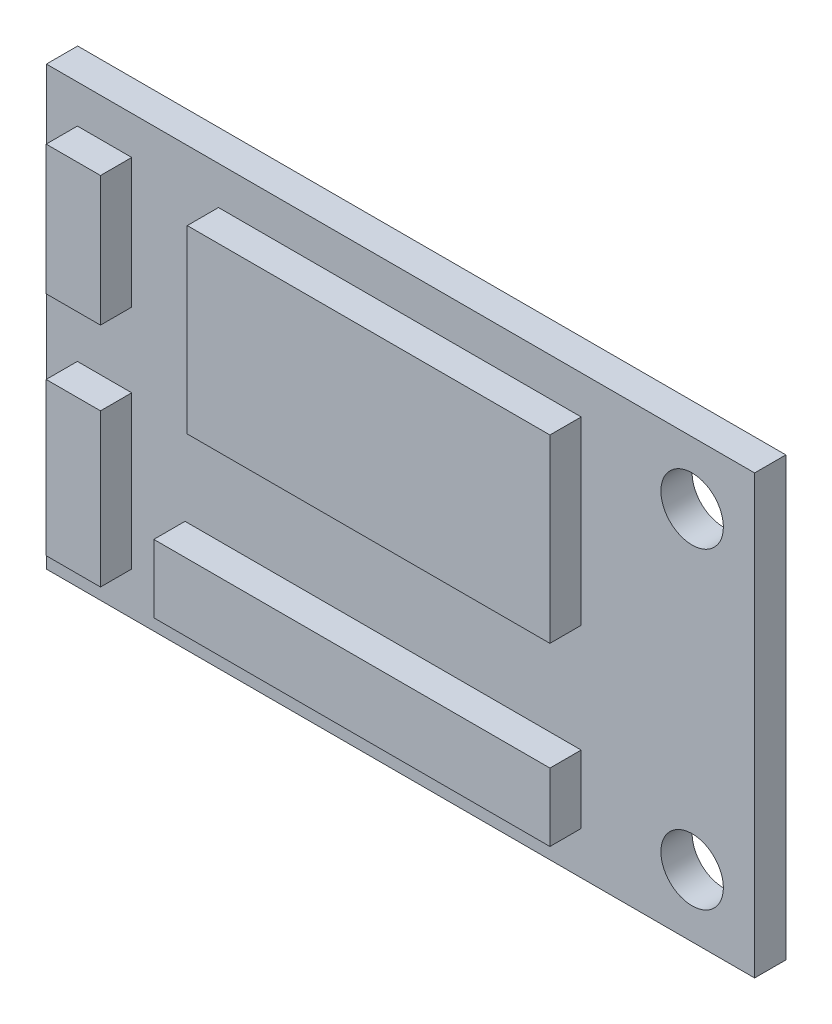
ISO-10303-21;
HEADER;
FILE_DESCRIPTION(('STEP AP214'),'2;1');
FILE_NAME('part.step','',(''),(''),'','','');
FILE_SCHEMA(('AUTOMOTIVE_DESIGN { 1 0 10303 214 1 1 1 1 }'));
ENDSEC;
DATA;
#1=APPLICATION_CONTEXT('core data for automotive mechanical design processes');
#2=APPLICATION_PROTOCOL_DEFINITION('international standard','automotive_design',2000,#1);
#3=PRODUCT_CONTEXT('',#1,'mechanical');
#4=PRODUCT('Part','Part','',(#3));
#5=PRODUCT_RELATED_PRODUCT_CATEGORY('part','',(#4));
#6=PRODUCT_DEFINITION_FORMATION('','',#4);
#7=PRODUCT_DEFINITION_CONTEXT('part definition',#1,'design');
#8=PRODUCT_DEFINITION('design','',#6,#7);
#9=PRODUCT_DEFINITION_SHAPE('','',#8);
#10=(LENGTH_UNIT() NAMED_UNIT(*) SI_UNIT(.MILLI.,.METRE.));
#11=(NAMED_UNIT(*) PLANE_ANGLE_UNIT() SI_UNIT($,.RADIAN.));
#12=(NAMED_UNIT(*) SI_UNIT($,.STERADIAN.) SOLID_ANGLE_UNIT());
#13=UNCERTAINTY_MEASURE_WITH_UNIT(LENGTH_MEASURE(1.E-05),#10,'distance_accuracy_value','');
#14=(GEOMETRIC_REPRESENTATION_CONTEXT(3) GLOBAL_UNCERTAINTY_ASSIGNED_CONTEXT((#13)) GLOBAL_UNIT_ASSIGNED_CONTEXT((#10,
#11,#12)) REPRESENTATION_CONTEXT('',''));
#15=CARTESIAN_POINT('',(0.,0.,0.));
#16=DIRECTION('',(0.,0.,1.));
#17=DIRECTION('',(1.,0.,0.));
#18=AXIS2_PLACEMENT_3D('',#15,#16,#17);
#19=CARTESIAN_POINT('',(0.,0.,1.5));
#20=DIRECTION('',(0.,0.,1.));
#21=DIRECTION('',(1.,0.,0.));
#22=AXIS2_PLACEMENT_3D('',#19,#20,#21);
#23=PLANE('',#22);
#24=CARTESIAN_POINT('',(14.,7.5,1.5));
#25=DIRECTION('',(0.,0.,1.));
#26=DIRECTION('',(1.,0.,0.));
#27=AXIS2_PLACEMENT_3D('',#24,#25,#26);
#28=CIRCLE('',#27,1.5);
#29=CARTESIAN_POINT('',(15.5,7.5,1.5));
#30=VERTEX_POINT('',#29);
#31=EDGE_CURVE('E305',#30,#30,#28,.T.);
#32=ORIENTED_EDGE('',*,*,#31,.F.);
#33=EDGE_LOOP('',(#32));
#34=FACE_BOUND('',#33,.T.);
#35=DIRECTION('',(0.,-1.,0.));
#36=VECTOR('',#35,1.);
#37=CARTESIAN_POINT('',(-17.,-10.5,1.5));
#38=LINE('',#37,#36);
#39=CARTESIAN_POINT('',(-17.,10.5,1.5));
#40=VERTEX_POINT('',#39);
#41=CARTESIAN_POINT('',(-17.,-10.5,1.5));
#42=VERTEX_POINT('',#41);
#43=EDGE_CURVE('E312',#40,#42,#38,.T.);
#44=ORIENTED_EDGE('',*,*,#43,.T.);
#45=DIRECTION('',(1.,0.,0.));
#46=VECTOR('',#45,1.);
#47=CARTESIAN_POINT('',(17.,-10.5,1.5));
#48=LINE('',#47,#46);
#49=CARTESIAN_POINT('',(17.,-10.5,1.5));
#50=VERTEX_POINT('',#49);
#51=EDGE_CURVE('E316',#42,#50,#48,.T.);
#52=ORIENTED_EDGE('',*,*,#51,.T.);
#53=DIRECTION('',(0.,1.,0.));
#54=VECTOR('',#53,1.);
#55=CARTESIAN_POINT('',(17.,-10.5,1.5));
#56=LINE('',#55,#54);
#57=CARTESIAN_POINT('',(17.,10.5,1.5));
#58=VERTEX_POINT('',#57);
#59=EDGE_CURVE('E319',#50,#58,#56,.T.);
#60=ORIENTED_EDGE('',*,*,#59,.T.);
#61=DIRECTION('',(-1.,0.,0.));
#62=VECTOR('',#61,1.);
#63=CARTESIAN_POINT('',(17.,10.5,1.5));
#64=LINE('',#63,#62);
#65=EDGE_CURVE('E322',#58,#40,#64,.T.);
#66=ORIENTED_EDGE('',*,*,#65,.T.);
#67=EDGE_LOOP('',(#44,#52,#60,#66));
#68=FACE_BOUND('',#67,.T.);
#69=CARTESIAN_POINT('',(14.,-7.5,1.5));
#70=DIRECTION('',(0.,0.,1.));
#71=DIRECTION('',(1.,0.,0.));
#72=AXIS2_PLACEMENT_3D('',#69,#70,#71);
#73=CIRCLE('',#72,1.5);
#74=CARTESIAN_POINT('',(15.5,-7.5,1.5));
#75=VERTEX_POINT('',#74);
#76=EDGE_CURVE('E297',#75,#75,#73,.T.);
#77=ORIENTED_EDGE('',*,*,#76,.F.);
#78=EDGE_LOOP('',(#77));
#79=FACE_BOUND('',#78,.T.);
#80=DIRECTION('',(1.,0.,0.));
#81=VECTOR('',#80,1.);
#82=CARTESIAN_POINT('',(-15.5131375674324,2.44222509799984,1.5));
#83=LINE('',#82,#81);
#84=CARTESIAN_POINT('',(-15.5131375674324,2.44222509799984,1.5));
#85=VERTEX_POINT('',#84);
#86=CARTESIAN_POINT('',(-12.9038053424862,2.44222509799984,1.5));
#87=VERTEX_POINT('',#86);
#88=EDGE_CURVE('E281',#85,#87,#83,.T.);
#89=ORIENTED_EDGE('',*,*,#88,.F.);
#90=DIRECTION('',(0.,-1.,0.));
#91=VECTOR('',#90,1.);
#92=CARTESIAN_POINT('',(-15.5131375674324,8.66447886517924,1.5));
#93=LINE('',#92,#91);
#94=CARTESIAN_POINT('',(-15.5131375674324,8.66447886517924,1.5));
#95=VERTEX_POINT('',#94);
#96=EDGE_CURVE('E266',#95,#85,#93,.T.);
#97=ORIENTED_EDGE('',*,*,#96,.F.);
#98=DIRECTION('',(-1.,0.,0.));
#99=VECTOR('',#98,1.);
#100=CARTESIAN_POINT('',(-15.5131375674324,8.66447886517924,1.5));
#101=LINE('',#100,#99);
#102=CARTESIAN_POINT('',(-12.9038053424862,8.66447886517924,1.5));
#103=VERTEX_POINT('',#102);
#104=EDGE_CURVE('E272',#103,#95,#101,.T.);
#105=ORIENTED_EDGE('',*,*,#104,.F.);
#106=DIRECTION('',(0.,1.,0.));
#107=VECTOR('',#106,1.);
#108=CARTESIAN_POINT('',(-12.9038053424862,8.66447886517924,1.5));
#109=LINE('',#108,#107);
#110=EDGE_CURVE('E283',#87,#103,#109,.T.);
#111=ORIENTED_EDGE('',*,*,#110,.F.);
#112=EDGE_LOOP('',(#89,#97,#105,#111));
#113=FACE_BOUND('',#112,.T.);
#114=DIRECTION('',(1.,0.,0.));
#115=VECTOR('',#114,1.);
#116=CARTESIAN_POINT('',(-15.5131375674324,-8.4467189945641,1.5));
#117=LINE('',#116,#115);
#118=CARTESIAN_POINT('',(-15.5131375674324,-8.4467189945641,1.5));
#119=VERTEX_POINT('',#118);
#120=CARTESIAN_POINT('',(-12.9038053424862,-8.4467189945641,1.5));
#121=VERTEX_POINT('',#120);
#122=EDGE_CURVE('E251',#119,#121,#117,.T.);
#123=ORIENTED_EDGE('',*,*,#122,.F.);
#124=DIRECTION('',(0.,-1.,0.));
#125=VECTOR('',#124,1.);
#126=CARTESIAN_POINT('',(-15.5131375674324,-1.120516978369,1.5));
#127=LINE('',#126,#125);
#128=CARTESIAN_POINT('',(-15.5131375674324,-1.120516978369,1.5));
#129=VERTEX_POINT('',#128);
#130=EDGE_CURVE('E237',#129,#119,#127,.T.);
#131=ORIENTED_EDGE('',*,*,#130,.F.);
#132=DIRECTION('',(-1.,0.,0.));
#133=VECTOR('',#132,1.);
#134=CARTESIAN_POINT('',(-15.5131375674324,-1.120516978369,1.5));
#135=LINE('',#134,#133);
#136=CARTESIAN_POINT('',(-12.9038053424862,-1.120516978369,1.5));
#137=VERTEX_POINT('',#136);
#138=EDGE_CURVE('E242',#137,#129,#135,.T.);
#139=ORIENTED_EDGE('',*,*,#138,.F.);
#140=DIRECTION('',(0.,1.,0.));
#141=VECTOR('',#140,1.);
#142=CARTESIAN_POINT('',(-12.9038053424862,-1.120516978369,1.5));
#143=LINE('',#142,#141);
#144=EDGE_CURVE('E253',#121,#137,#143,.T.);
#145=ORIENTED_EDGE('',*,*,#144,.F.);
#146=EDGE_LOOP('',(#123,#131,#139,#145));
#147=FACE_BOUND('',#146,.T.);
#148=DIRECTION('',(1.,0.,0.));
#149=VECTOR('',#148,1.);
#150=CARTESIAN_POINT('',(-8.7389096757451,0.,1.5));
#151=LINE('',#150,#149);
#152=CARTESIAN_POINT('',(-8.7389096757451,0.,1.5));
#153=VERTEX_POINT('',#152);
#154=CARTESIAN_POINT('',(8.67336497918434,0.,1.5));
#155=VERTEX_POINT('',#154);
#156=EDGE_CURVE('E206',#153,#155,#151,.T.);
#157=ORIENTED_EDGE('',*,*,#156,.F.);
#158=DIRECTION('',(0.,-1.,0.));
#159=VECTOR('',#158,1.);
#160=CARTESIAN_POINT('',(-8.7389096757451,8.66447886517924,1.5));
#161=LINE('',#160,#159);
#162=CARTESIAN_POINT('',(-8.7389096757451,8.66447886517924,1.5));
#163=VERTEX_POINT('',#162);
#164=EDGE_CURVE('E202',#163,#153,#161,.T.);
#165=ORIENTED_EDGE('',*,*,#164,.F.);
#166=DIRECTION('',(-1.,0.,0.));
#167=VECTOR('',#166,1.);
#168=CARTESIAN_POINT('',(-8.7389096757451,8.66447886517924,1.5));
#169=LINE('',#168,#167);
#170=CARTESIAN_POINT('',(8.67336497918434,8.66447886517924,1.5));
#171=VERTEX_POINT('',#170);
#172=EDGE_CURVE('E216',#171,#163,#169,.T.);
#173=ORIENTED_EDGE('',*,*,#172,.F.);
#174=DIRECTION('',(0.,1.,0.));
#175=VECTOR('',#174,1.);
#176=CARTESIAN_POINT('',(8.67336497918434,8.66447886517924,1.5));
#177=LINE('',#176,#175);
#178=EDGE_CURVE('E226',#155,#171,#177,.T.);
#179=ORIENTED_EDGE('',*,*,#178,.F.);
#180=EDGE_LOOP('',(#157,#165,#173,#179));
#181=FACE_BOUND('',#180,.T.);
#182=DIRECTION('',(1.,0.,0.));
#183=VECTOR('',#182,1.);
#184=CARTESIAN_POINT('',(-10.3446525834043,-8.4467189945641,1.5));
#185=LINE('',#184,#183);
#186=CARTESIAN_POINT('',(-10.3446525834043,-8.4467189945641,1.5));
#187=VERTEX_POINT('',#186);
#188=CARTESIAN_POINT('',(8.67336497918434,-8.4467189945641,1.5));
#189=VERTEX_POINT('',#188);
#190=EDGE_CURVE('E618',#187,#189,#185,.T.);
#191=ORIENTED_EDGE('',*,*,#190,.F.);
#192=DIRECTION('',(0.,-1.,0.));
#193=VECTOR('',#192,1.);
#194=CARTESIAN_POINT('',(-10.3446525834043,-8.4467189945641,1.5));
#195=LINE('',#194,#193);
#196=CARTESIAN_POINT('',(-10.3446525834043,-5.18505371338135,1.5));
#197=VERTEX_POINT('',#196);
#198=EDGE_CURVE('E200',#197,#187,#195,.T.);
#199=ORIENTED_EDGE('',*,*,#198,.F.);
#200=DIRECTION('',(-1.,0.,0.));
#201=VECTOR('',#200,1.);
#202=CARTESIAN_POINT('',(-10.3446525834043,-5.18505371338135,1.5));
#203=LINE('',#202,#201);
#204=CARTESIAN_POINT('',(8.67336497918434,-5.18505371338135,1.5));
#205=VERTEX_POINT('',#204);
#206=EDGE_CURVE('E196',#205,#197,#203,.T.);
#207=ORIENTED_EDGE('',*,*,#206,.F.);
#208=DIRECTION('',(0.,1.,0.));
#209=VECTOR('',#208,1.);
#210=CARTESIAN_POINT('',(8.67336497918434,-8.4467189945641,1.5));
#211=LINE('',#210,#209);
#212=EDGE_CURVE('E614',#189,#205,#211,.T.);
#213=ORIENTED_EDGE('',*,*,#212,.F.);
#214=EDGE_LOOP('',(#191,#199,#207,#213));
#215=FACE_BOUND('',#214,.T.);
#216=ADVANCED_FACE('F38',(#34,#68,#79,#113,#147,#181,#215),#23,.T.);
#217=CARTESIAN_POINT('',(0.,0.,0.));
#218=DIRECTION('',(0.,0.,1.));
#219=DIRECTION('',(1.,0.,0.));
#220=AXIS2_PLACEMENT_3D('',#217,#218,#219);
#221=PLANE('',#220);
#222=DIRECTION('',(0.,-1.,0.));
#223=VECTOR('',#222,1.);
#224=CARTESIAN_POINT('',(-17.,-10.5,0.));
#225=LINE('',#224,#223);
#226=CARTESIAN_POINT('',(-17.,10.5,0.));
#227=VERTEX_POINT('',#226);
#228=CARTESIAN_POINT('',(-17.,-10.5,0.));
#229=VERTEX_POINT('',#228);
#230=EDGE_CURVE('E308',#227,#229,#225,.T.);
#231=ORIENTED_EDGE('',*,*,#230,.F.);
#232=DIRECTION('',(-1.,0.,0.));
#233=VECTOR('',#232,1.);
#234=CARTESIAN_POINT('',(17.,10.5,0.));
#235=LINE('',#234,#233);
#236=CARTESIAN_POINT('',(17.,10.5,0.));
#237=VERTEX_POINT('',#236);
#238=EDGE_CURVE('E317',#237,#227,#235,.T.);
#239=ORIENTED_EDGE('',*,*,#238,.F.);
#240=DIRECTION('',(0.,1.,0.));
#241=VECTOR('',#240,1.);
#242=CARTESIAN_POINT('',(17.,-10.5,0.));
#243=LINE('',#242,#241);
#244=CARTESIAN_POINT('',(17.,-10.5,0.));
#245=VERTEX_POINT('',#244);
#246=EDGE_CURVE('E330',#245,#237,#243,.T.);
#247=ORIENTED_EDGE('',*,*,#246,.F.);
#248=DIRECTION('',(1.,0.,0.));
#249=VECTOR('',#248,1.);
#250=CARTESIAN_POINT('',(17.,-10.5,0.));
#251=LINE('',#250,#249);
#252=EDGE_CURVE('E328',#229,#245,#251,.T.);
#253=ORIENTED_EDGE('',*,*,#252,.F.);
#254=EDGE_LOOP('',(#231,#239,#247,#253));
#255=FACE_BOUND('',#254,.T.);
#256=CARTESIAN_POINT('',(14.,7.5,0.));
#257=DIRECTION('',(0.,0.,1.));
#258=DIRECTION('',(1.,0.,0.));
#259=AXIS2_PLACEMENT_3D('',#256,#257,#258);
#260=CIRCLE('',#259,1.5);
#261=CARTESIAN_POINT('',(15.5,7.5,0.));
#262=VERTEX_POINT('',#261);
#263=EDGE_CURVE('E301',#262,#262,#260,.T.);
#264=ORIENTED_EDGE('',*,*,#263,.T.);
#265=EDGE_LOOP('',(#264));
#266=FACE_BOUND('',#265,.T.);
#267=CARTESIAN_POINT('',(14.,-7.5,0.));
#268=DIRECTION('',(0.,0.,1.));
#269=DIRECTION('',(1.,0.,0.));
#270=AXIS2_PLACEMENT_3D('',#267,#268,#269);
#271=CIRCLE('',#270,1.5);
#272=CARTESIAN_POINT('',(15.5,-7.5,0.));
#273=VERTEX_POINT('',#272);
#274=EDGE_CURVE('E296',#273,#273,#271,.T.);
#275=ORIENTED_EDGE('',*,*,#274,.T.);
#276=EDGE_LOOP('',(#275));
#277=FACE_BOUND('',#276,.T.);
#278=ADVANCED_FACE('F351',(#255,#266,#277),#221,.F.);
#279=CARTESIAN_POINT('',(-17.,-10.5,1.5));
#280=DIRECTION('',(1.,0.,0.));
#281=DIRECTION('',(0.,0.,-1.));
#282=AXIS2_PLACEMENT_3D('',#279,#280,#281);
#283=PLANE('',#282);
#284=ORIENTED_EDGE('',*,*,#230,.T.);
#285=DIRECTION('',(0.,0.,-1.));
#286=VECTOR('',#285,1.);
#287=CARTESIAN_POINT('',(-17.,-10.5,1.5));
#288=LINE('',#287,#286);
#289=EDGE_CURVE('E11',#42,#229,#288,.T.);
#290=ORIENTED_EDGE('',*,*,#289,.F.);
#291=ORIENTED_EDGE('',*,*,#43,.F.);
#292=DIRECTION('',(0.,0.,-1.));
#293=VECTOR('',#292,1.);
#294=CARTESIAN_POINT('',(-17.,10.5,1.5));
#295=LINE('',#294,#293);
#296=EDGE_CURVE('E325',#40,#227,#295,.T.);
#297=ORIENTED_EDGE('',*,*,#296,.T.);
#298=EDGE_LOOP('',(#284,#290,#291,#297));
#299=FACE_BOUND('',#298,.T.);
#300=ADVANCED_FACE('F40',(#299),#283,.F.);
#301=CARTESIAN_POINT('',(17.,-10.5,1.5));
#302=DIRECTION('',(0.,1.,0.));
#303=DIRECTION('',(-1.,0.,0.));
#304=AXIS2_PLACEMENT_3D('',#301,#302,#303);
#305=PLANE('',#304);
#306=ORIENTED_EDGE('',*,*,#252,.T.);
#307=DIRECTION('',(0.,0.,-1.));
#308=VECTOR('',#307,1.);
#309=CARTESIAN_POINT('',(17.,-10.5,1.5));
#310=LINE('',#309,#308);
#311=EDGE_CURVE('E46',#50,#245,#310,.T.);
#312=ORIENTED_EDGE('',*,*,#311,.F.);
#313=ORIENTED_EDGE('',*,*,#51,.F.);
#314=ORIENTED_EDGE('',*,*,#289,.T.);
#315=EDGE_LOOP('',(#306,#312,#313,#314));
#316=FACE_BOUND('',#315,.T.);
#317=ADVANCED_FACE('F362',(#316),#305,.F.);
#318=CARTESIAN_POINT('',(17.,-10.5,1.5));
#319=DIRECTION('',(-1.,0.,0.));
#320=DIRECTION('',(0.,0.,1.));
#321=AXIS2_PLACEMENT_3D('',#318,#319,#320);
#322=PLANE('',#321);
#323=ORIENTED_EDGE('',*,*,#246,.T.);
#324=DIRECTION('',(0.,0.,-1.));
#325=VECTOR('',#324,1.);
#326=CARTESIAN_POINT('',(17.,10.5,1.5));
#327=LINE('',#326,#325);
#328=EDGE_CURVE('E337',#58,#237,#327,.T.);
#329=ORIENTED_EDGE('',*,*,#328,.F.);
#330=ORIENTED_EDGE('',*,*,#59,.F.);
#331=ORIENTED_EDGE('',*,*,#311,.T.);
#332=EDGE_LOOP('',(#323,#329,#330,#331));
#333=FACE_BOUND('',#332,.T.);
#334=ADVANCED_FACE('F345',(#333),#322,.F.);
#335=CARTESIAN_POINT('',(17.,10.5,1.5));
#336=DIRECTION('',(0.,-1.,0.));
#337=DIRECTION('',(1.,0.,0.));
#338=AXIS2_PLACEMENT_3D('',#335,#336,#337);
#339=PLANE('',#338);
#340=ORIENTED_EDGE('',*,*,#238,.T.);
#341=ORIENTED_EDGE('',*,*,#296,.F.);
#342=ORIENTED_EDGE('',*,*,#65,.F.);
#343=ORIENTED_EDGE('',*,*,#328,.T.);
#344=EDGE_LOOP('',(#340,#341,#342,#343));
#345=FACE_BOUND('',#344,.T.);
#346=ADVANCED_FACE('F355',(#345),#339,.F.);
#347=CARTESIAN_POINT('',(14.,7.5,1.5));
#348=DIRECTION('',(0.,0.,-1.));
#349=DIRECTION('',(-1.,0.,0.));
#350=AXIS2_PLACEMENT_3D('',#347,#348,#349);
#351=CYLINDRICAL_SURFACE('',#350,1.5);
#352=ORIENTED_EDGE('',*,*,#31,.T.);
#353=EDGE_LOOP('',(#352));
#354=FACE_BOUND('',#353,.T.);
#355=ORIENTED_EDGE('',*,*,#263,.F.);
#356=EDGE_LOOP('',(#355));
#357=FACE_BOUND('',#356,.T.);
#358=ADVANCED_FACE('F378',(#354,#357),#351,.F.);
#359=CARTESIAN_POINT('',(14.,-7.5,1.5));
#360=DIRECTION('',(0.,0.,-1.));
#361=DIRECTION('',(-1.,0.,0.));
#362=AXIS2_PLACEMENT_3D('',#359,#360,#361);
#363=CYLINDRICAL_SURFACE('',#362,1.5);
#364=ORIENTED_EDGE('',*,*,#76,.T.);
#365=EDGE_LOOP('',(#364));
#366=FACE_BOUND('',#365,.T.);
#367=ORIENTED_EDGE('',*,*,#274,.F.);
#368=EDGE_LOOP('',(#367));
#369=FACE_BOUND('',#368,.T.);
#370=ADVANCED_FACE('F385',(#366,#369),#363,.F.);
#371=CARTESIAN_POINT('',(-15.5131375674324,8.66447886517924,3.));
#372=DIRECTION('',(1.,0.,0.));
#373=DIRECTION('',(0.,0.,-1.));
#374=AXIS2_PLACEMENT_3D('',#371,#372,#373);
#375=PLANE('',#374);
#376=ORIENTED_EDGE('',*,*,#96,.T.);
#377=DIRECTION('',(0.,0.,-1.));
#378=VECTOR('',#377,1.);
#379=CARTESIAN_POINT('',(-15.5131375674324,2.44222509799984,3.));
#380=LINE('',#379,#378);
#381=CARTESIAN_POINT('',(-15.5131375674324,2.44222509799984,3.));
#382=VERTEX_POINT('',#381);
#383=EDGE_CURVE('E294',#382,#85,#380,.T.);
#384=ORIENTED_EDGE('',*,*,#383,.F.);
#385=DIRECTION('',(0.,-1.,0.));
#386=VECTOR('',#385,1.);
#387=CARTESIAN_POINT('',(-15.5131375674324,8.66447886517924,3.));
#388=LINE('',#387,#386);
#389=CARTESIAN_POINT('',(-15.5131375674324,8.66447886517924,3.));
#390=VERTEX_POINT('',#389);
#391=EDGE_CURVE('E267',#390,#382,#388,.T.);
#392=ORIENTED_EDGE('',*,*,#391,.F.);
#393=DIRECTION('',(0.,0.,-1.));
#394=VECTOR('',#393,1.);
#395=CARTESIAN_POINT('',(-15.5131375674324,8.66447886517924,3.));
#396=LINE('',#395,#394);
#397=EDGE_CURVE('E278',#390,#95,#396,.T.);
#398=ORIENTED_EDGE('',*,*,#397,.T.);
#399=EDGE_LOOP('',(#376,#384,#392,#398));
#400=FACE_BOUND('',#399,.T.);
#401=ADVANCED_FACE('F390',(#400),#375,.F.);
#402=CARTESIAN_POINT('',(-15.5131375674324,2.44222509799984,3.));
#403=DIRECTION('',(0.,1.,0.));
#404=DIRECTION('',(0.,0.,1.));
#405=AXIS2_PLACEMENT_3D('',#402,#403,#404);
#406=PLANE('',#405);
#407=ORIENTED_EDGE('',*,*,#88,.T.);
#408=DIRECTION('',(0.,0.,-1.));
#409=VECTOR('',#408,1.);
#410=CARTESIAN_POINT('',(-12.9038053424862,2.44222509799984,3.));
#411=LINE('',#410,#409);
#412=CARTESIAN_POINT('',(-12.9038053424862,2.44222509799984,3.));
#413=VERTEX_POINT('',#412);
#414=EDGE_CURVE('E291',#413,#87,#411,.T.);
#415=ORIENTED_EDGE('',*,*,#414,.F.);
#416=DIRECTION('',(1.,0.,0.));
#417=VECTOR('',#416,1.);
#418=CARTESIAN_POINT('',(-15.5131375674324,2.44222509799984,3.));
#419=LINE('',#418,#417);
#420=EDGE_CURVE('E271',#382,#413,#419,.T.);
#421=ORIENTED_EDGE('',*,*,#420,.F.);
#422=ORIENTED_EDGE('',*,*,#383,.T.);
#423=EDGE_LOOP('',(#407,#415,#421,#422));
#424=FACE_BOUND('',#423,.T.);
#425=ADVANCED_FACE('F400',(#424),#406,.F.);
#426=CARTESIAN_POINT('',(-12.9038053424862,8.66447886517924,3.));
#427=DIRECTION('',(-1.,0.,0.));
#428=DIRECTION('',(0.,0.,1.));
#429=AXIS2_PLACEMENT_3D('',#426,#427,#428);
#430=PLANE('',#429);
#431=ORIENTED_EDGE('',*,*,#110,.T.);
#432=DIRECTION('',(0.,0.,-1.));
#433=VECTOR('',#432,1.);
#434=CARTESIAN_POINT('',(-12.9038053424862,8.66447886517924,3.));
#435=LINE('',#434,#433);
#436=CARTESIAN_POINT('',(-12.9038053424862,8.66447886517924,3.));
#437=VERTEX_POINT('',#436);
#438=EDGE_CURVE('E289',#437,#103,#435,.T.);
#439=ORIENTED_EDGE('',*,*,#438,.F.);
#440=DIRECTION('',(0.,1.,0.));
#441=VECTOR('',#440,1.);
#442=CARTESIAN_POINT('',(-12.9038053424862,8.66447886517924,3.));
#443=LINE('',#442,#441);
#444=EDGE_CURVE('E274',#413,#437,#443,.T.);
#445=ORIENTED_EDGE('',*,*,#444,.F.);
#446=ORIENTED_EDGE('',*,*,#414,.T.);
#447=EDGE_LOOP('',(#431,#439,#445,#446));
#448=FACE_BOUND('',#447,.T.);
#449=ADVANCED_FACE('F406',(#448),#430,.F.);
#450=CARTESIAN_POINT('',(-15.5131375674324,8.66447886517924,3.));
#451=DIRECTION('',(0.,-1.,0.));
#452=DIRECTION('',(0.,0.,-1.));
#453=AXIS2_PLACEMENT_3D('',#450,#451,#452);
#454=PLANE('',#453);
#455=ORIENTED_EDGE('',*,*,#104,.T.);
#456=ORIENTED_EDGE('',*,*,#397,.F.);
#457=DIRECTION('',(-1.,0.,0.));
#458=VECTOR('',#457,1.);
#459=CARTESIAN_POINT('',(-15.5131375674324,8.66447886517924,3.));
#460=LINE('',#459,#458);
#461=EDGE_CURVE('E276',#437,#390,#460,.T.);
#462=ORIENTED_EDGE('',*,*,#461,.F.);
#463=ORIENTED_EDGE('',*,*,#438,.T.);
#464=EDGE_LOOP('',(#455,#456,#462,#463));
#465=FACE_BOUND('',#464,.T.);
#466=ADVANCED_FACE('F410',(#465),#454,.F.);
#467=CARTESIAN_POINT('',(0.,0.,3.));
#468=DIRECTION('',(0.,0.,1.));
#469=DIRECTION('',(1.,0.,0.));
#470=AXIS2_PLACEMENT_3D('',#467,#468,#469);
#471=PLANE('',#470);
#472=ORIENTED_EDGE('',*,*,#391,.T.);
#473=ORIENTED_EDGE('',*,*,#420,.T.);
#474=ORIENTED_EDGE('',*,*,#444,.T.);
#475=ORIENTED_EDGE('',*,*,#461,.T.);
#476=EDGE_LOOP('',(#472,#473,#474,#475));
#477=FACE_BOUND('',#476,.T.);
#478=ADVANCED_FACE('F414',(#477),#471,.T.);
#479=CARTESIAN_POINT('',(-15.5131375674324,-1.120516978369,3.));
#480=DIRECTION('',(1.,0.,0.));
#481=DIRECTION('',(0.,0.,-1.));
#482=AXIS2_PLACEMENT_3D('',#479,#480,#481);
#483=PLANE('',#482);
#484=ORIENTED_EDGE('',*,*,#130,.T.);
#485=DIRECTION('',(0.,0.,-1.));
#486=VECTOR('',#485,1.);
#487=CARTESIAN_POINT('',(-15.5131375674324,-8.4467189945641,3.));
#488=LINE('',#487,#486);
#489=CARTESIAN_POINT('',(-15.5131375674324,-8.4467189945641,3.));
#490=VERTEX_POINT('',#489);
#491=EDGE_CURVE('E264',#490,#119,#488,.T.);
#492=ORIENTED_EDGE('',*,*,#491,.F.);
#493=DIRECTION('',(0.,-1.,0.));
#494=VECTOR('',#493,1.);
#495=CARTESIAN_POINT('',(-15.5131375674324,-1.120516978369,3.));
#496=LINE('',#495,#494);
#497=CARTESIAN_POINT('',(-15.5131375674324,-1.120516978369,3.));
#498=VERTEX_POINT('',#497);
#499=EDGE_CURVE('E238',#498,#490,#496,.T.);
#500=ORIENTED_EDGE('',*,*,#499,.F.);
#501=DIRECTION('',(0.,0.,-1.));
#502=VECTOR('',#501,1.);
#503=CARTESIAN_POINT('',(-15.5131375674324,-1.120516978369,3.));
#504=LINE('',#503,#502);
#505=EDGE_CURVE('E248',#498,#129,#504,.T.);
#506=ORIENTED_EDGE('',*,*,#505,.T.);
#507=EDGE_LOOP('',(#484,#492,#500,#506));
#508=FACE_BOUND('',#507,.T.);
#509=ADVANCED_FACE('F418',(#508),#483,.F.);
#510=CARTESIAN_POINT('',(-15.5131375674324,-8.4467189945641,3.));
#511=DIRECTION('',(0.,1.,0.));
#512=DIRECTION('',(0.,0.,1.));
#513=AXIS2_PLACEMENT_3D('',#510,#511,#512);
#514=PLANE('',#513);
#515=ORIENTED_EDGE('',*,*,#122,.T.);
#516=DIRECTION('',(0.,0.,-1.));
#517=VECTOR('',#516,1.);
#518=CARTESIAN_POINT('',(-12.9038053424862,-8.4467189945641,3.));
#519=LINE('',#518,#517);
#520=CARTESIAN_POINT('',(-12.9038053424862,-8.4467189945641,3.));
#521=VERTEX_POINT('',#520);
#522=EDGE_CURVE('E261',#521,#121,#519,.T.);
#523=ORIENTED_EDGE('',*,*,#522,.F.);
#524=DIRECTION('',(1.,0.,0.));
#525=VECTOR('',#524,1.);
#526=CARTESIAN_POINT('',(-15.5131375674324,-8.4467189945641,3.));
#527=LINE('',#526,#525);
#528=EDGE_CURVE('E241',#490,#521,#527,.T.);
#529=ORIENTED_EDGE('',*,*,#528,.F.);
#530=ORIENTED_EDGE('',*,*,#491,.T.);
#531=EDGE_LOOP('',(#515,#523,#529,#530));
#532=FACE_BOUND('',#531,.T.);
#533=ADVANCED_FACE('F422',(#532),#514,.F.);
#534=CARTESIAN_POINT('',(-12.9038053424862,-1.120516978369,3.));
#535=DIRECTION('',(-1.,0.,0.));
#536=DIRECTION('',(0.,0.,1.));
#537=AXIS2_PLACEMENT_3D('',#534,#535,#536);
#538=PLANE('',#537);
#539=ORIENTED_EDGE('',*,*,#144,.T.);
#540=DIRECTION('',(0.,0.,-1.));
#541=VECTOR('',#540,1.);
#542=CARTESIAN_POINT('',(-12.9038053424862,-1.120516978369,3.));
#543=LINE('',#542,#541);
#544=CARTESIAN_POINT('',(-12.9038053424862,-1.120516978369,3.));
#545=VERTEX_POINT('',#544);
#546=EDGE_CURVE('E259',#545,#137,#543,.T.);
#547=ORIENTED_EDGE('',*,*,#546,.F.);
#548=DIRECTION('',(0.,1.,0.));
#549=VECTOR('',#548,1.);
#550=CARTESIAN_POINT('',(-12.9038053424862,-1.120516978369,3.));
#551=LINE('',#550,#549);
#552=EDGE_CURVE('E244',#521,#545,#551,.T.);
#553=ORIENTED_EDGE('',*,*,#552,.F.);
#554=ORIENTED_EDGE('',*,*,#522,.T.);
#555=EDGE_LOOP('',(#539,#547,#553,#554));
#556=FACE_BOUND('',#555,.T.);
#557=ADVANCED_FACE('F426',(#556),#538,.F.);
#558=CARTESIAN_POINT('',(-15.5131375674324,-1.120516978369,3.));
#559=DIRECTION('',(0.,-1.,0.));
#560=DIRECTION('',(0.,0.,-1.));
#561=AXIS2_PLACEMENT_3D('',#558,#559,#560);
#562=PLANE('',#561);
#563=ORIENTED_EDGE('',*,*,#138,.T.);
#564=ORIENTED_EDGE('',*,*,#505,.F.);
#565=DIRECTION('',(-1.,0.,0.));
#566=VECTOR('',#565,1.);
#567=CARTESIAN_POINT('',(-15.5131375674324,-1.120516978369,3.));
#568=LINE('',#567,#566);
#569=EDGE_CURVE('E246',#545,#498,#568,.T.);
#570=ORIENTED_EDGE('',*,*,#569,.F.);
#571=ORIENTED_EDGE('',*,*,#546,.T.);
#572=EDGE_LOOP('',(#563,#564,#570,#571));
#573=FACE_BOUND('',#572,.T.);
#574=ADVANCED_FACE('F430',(#573),#562,.F.);
#575=CARTESIAN_POINT('',(0.,0.,3.));
#576=DIRECTION('',(0.,0.,1.));
#577=DIRECTION('',(1.,0.,0.));
#578=AXIS2_PLACEMENT_3D('',#575,#576,#577);
#579=PLANE('',#578);
#580=ORIENTED_EDGE('',*,*,#499,.T.);
#581=ORIENTED_EDGE('',*,*,#528,.T.);
#582=ORIENTED_EDGE('',*,*,#552,.T.);
#583=ORIENTED_EDGE('',*,*,#569,.T.);
#584=EDGE_LOOP('',(#580,#581,#582,#583));
#585=FACE_BOUND('',#584,.T.);
#586=ADVANCED_FACE('F434',(#585),#579,.T.);
#587=CARTESIAN_POINT('',(-8.7389096757451,8.66447886517924,3.));
#588=DIRECTION('',(1.,0.,0.));
#589=DIRECTION('',(0.,0.,-1.));
#590=AXIS2_PLACEMENT_3D('',#587,#588,#589);
#591=PLANE('',#590);
#592=ORIENTED_EDGE('',*,*,#164,.T.);
#593=DIRECTION('',(0.,0.,-1.));
#594=VECTOR('',#593,1.);
#595=CARTESIAN_POINT('',(-8.7389096757451,0.,3.));
#596=LINE('',#595,#594);
#597=CARTESIAN_POINT('',(-8.7389096757451,0.,3.));
#598=VERTEX_POINT('',#597);
#599=EDGE_CURVE('E235',#598,#153,#596,.T.);
#600=ORIENTED_EDGE('',*,*,#599,.F.);
#601=DIRECTION('',(0.,-1.,0.));
#602=VECTOR('',#601,1.);
#603=CARTESIAN_POINT('',(-8.7389096757451,8.66447886517924,3.));
#604=LINE('',#603,#602);
#605=CARTESIAN_POINT('',(-8.7389096757451,8.66447886517924,3.));
#606=VERTEX_POINT('',#605);
#607=EDGE_CURVE('E211',#606,#598,#604,.T.);
#608=ORIENTED_EDGE('',*,*,#607,.F.);
#609=DIRECTION('',(0.,0.,-1.));
#610=VECTOR('',#609,1.);
#611=CARTESIAN_POINT('',(-8.7389096757451,8.66447886517924,3.));
#612=LINE('',#611,#610);
#613=EDGE_CURVE('E222',#606,#163,#612,.T.);
#614=ORIENTED_EDGE('',*,*,#613,.T.);
#615=EDGE_LOOP('',(#592,#600,#608,#614));
#616=FACE_BOUND('',#615,.T.);
#617=ADVANCED_FACE('F438',(#616),#591,.F.);
#618=CARTESIAN_POINT('',(-8.7389096757451,0.,3.));
#619=DIRECTION('',(0.,1.,0.));
#620=DIRECTION('',(0.,0.,1.));
#621=AXIS2_PLACEMENT_3D('',#618,#619,#620);
#622=PLANE('',#621);
#623=ORIENTED_EDGE('',*,*,#156,.T.);
#624=DIRECTION('',(0.,0.,-1.));
#625=VECTOR('',#624,1.);
#626=CARTESIAN_POINT('',(8.67336497918434,0.,3.));
#627=LINE('',#626,#625);
#628=CARTESIAN_POINT('',(8.67336497918434,0.,3.));
#629=VERTEX_POINT('',#628);
#630=EDGE_CURVE('E232',#629,#155,#627,.T.);
#631=ORIENTED_EDGE('',*,*,#630,.F.);
#632=DIRECTION('',(1.,0.,0.));
#633=VECTOR('',#632,1.);
#634=CARTESIAN_POINT('',(-8.7389096757451,0.,3.));
#635=LINE('',#634,#633);
#636=EDGE_CURVE('E215',#598,#629,#635,.T.);
#637=ORIENTED_EDGE('',*,*,#636,.F.);
#638=ORIENTED_EDGE('',*,*,#599,.T.);
#639=EDGE_LOOP('',(#623,#631,#637,#638));
#640=FACE_BOUND('',#639,.T.);
#641=ADVANCED_FACE('F442',(#640),#622,.F.);
#642=CARTESIAN_POINT('',(8.67336497918434,8.66447886517924,3.));
#643=DIRECTION('',(-1.,0.,0.));
#644=DIRECTION('',(0.,0.,1.));
#645=AXIS2_PLACEMENT_3D('',#642,#643,#644);
#646=PLANE('',#645);
#647=ORIENTED_EDGE('',*,*,#178,.T.);
#648=DIRECTION('',(0.,0.,-1.));
#649=VECTOR('',#648,1.);
#650=CARTESIAN_POINT('',(8.67336497918434,8.66447886517924,3.));
#651=LINE('',#650,#649);
#652=CARTESIAN_POINT('',(8.67336497918434,8.66447886517924,3.));
#653=VERTEX_POINT('',#652);
#654=EDGE_CURVE('E61',#653,#171,#651,.T.);
#655=ORIENTED_EDGE('',*,*,#654,.F.);
#656=DIRECTION('',(0.,1.,0.));
#657=VECTOR('',#656,1.);
#658=CARTESIAN_POINT('',(8.67336497918434,8.66447886517924,3.));
#659=LINE('',#658,#657);
#660=EDGE_CURVE('E219',#629,#653,#659,.T.);
#661=ORIENTED_EDGE('',*,*,#660,.F.);
#662=ORIENTED_EDGE('',*,*,#630,.T.);
#663=EDGE_LOOP('',(#647,#655,#661,#662));
#664=FACE_BOUND('',#663,.T.);
#665=ADVANCED_FACE('F446',(#664),#646,.F.);
#666=CARTESIAN_POINT('',(-8.7389096757451,8.66447886517924,3.));
#667=DIRECTION('',(0.,-1.,0.));
#668=DIRECTION('',(0.,0.,-1.));
#669=AXIS2_PLACEMENT_3D('',#666,#667,#668);
#670=PLANE('',#669);
#671=ORIENTED_EDGE('',*,*,#172,.T.);
#672=ORIENTED_EDGE('',*,*,#613,.F.);
#673=DIRECTION('',(-1.,0.,0.));
#674=VECTOR('',#673,1.);
#675=CARTESIAN_POINT('',(-8.7389096757451,8.66447886517924,3.));
#676=LINE('',#675,#674);
#677=EDGE_CURVE('E221',#653,#606,#676,.T.);
#678=ORIENTED_EDGE('',*,*,#677,.F.);
#679=ORIENTED_EDGE('',*,*,#654,.T.);
#680=EDGE_LOOP('',(#671,#672,#678,#679));
#681=FACE_BOUND('',#680,.T.);
#682=ADVANCED_FACE('F450',(#681),#670,.F.);
#683=CARTESIAN_POINT('',(0.,0.,3.));
#684=DIRECTION('',(0.,0.,1.));
#685=DIRECTION('',(1.,0.,0.));
#686=AXIS2_PLACEMENT_3D('',#683,#684,#685);
#687=PLANE('',#686);
#688=ORIENTED_EDGE('',*,*,#607,.T.);
#689=ORIENTED_EDGE('',*,*,#636,.T.);
#690=ORIENTED_EDGE('',*,*,#660,.T.);
#691=ORIENTED_EDGE('',*,*,#677,.T.);
#692=EDGE_LOOP('',(#688,#689,#690,#691));
#693=FACE_BOUND('',#692,.T.);
#694=ADVANCED_FACE('F454',(#693),#687,.T.);
#695=CARTESIAN_POINT('',(-10.3446525834043,-8.4467189945641,3.));
#696=DIRECTION('',(1.,0.,0.));
#697=DIRECTION('',(0.,0.,-1.));
#698=AXIS2_PLACEMENT_3D('',#695,#696,#697);
#699=PLANE('',#698);
#700=ORIENTED_EDGE('',*,*,#198,.T.);
#701=DIRECTION('',(0.,0.,-1.));
#702=VECTOR('',#701,1.);
#703=CARTESIAN_POINT('',(-10.3446525834043,-8.4467189945641,3.));
#704=LINE('',#703,#702);
#705=CARTESIAN_POINT('',(-10.3446525834043,-8.4467189945641,3.));
#706=VERTEX_POINT('',#705);
#707=EDGE_CURVE('E180',#706,#187,#704,.T.);
#708=ORIENTED_EDGE('',*,*,#707,.F.);
#709=DIRECTION('',(0.,-1.,0.));
#710=VECTOR('',#709,1.);
#711=CARTESIAN_POINT('',(-10.3446525834043,-8.4467189945641,3.));
#712=LINE('',#711,#710);
#713=CARTESIAN_POINT('',(-10.3446525834043,-5.18505371338135,3.));
#714=VERTEX_POINT('',#713);
#715=EDGE_CURVE('E188',#714,#706,#712,.T.);
#716=ORIENTED_EDGE('',*,*,#715,.F.);
#717=DIRECTION('',(0.,0.,-1.));
#718=VECTOR('',#717,1.);
#719=CARTESIAN_POINT('',(-10.3446525834043,-5.18505371338135,3.));
#720=LINE('',#719,#718);
#721=EDGE_CURVE('E623',#714,#197,#720,.T.);
#722=ORIENTED_EDGE('',*,*,#721,.T.);
#723=EDGE_LOOP('',(#700,#708,#716,#722));
#724=FACE_BOUND('',#723,.T.);
#725=ADVANCED_FACE('F198',(#724),#699,.F.);
#726=CARTESIAN_POINT('',(-10.3446525834043,-8.4467189945641,3.));
#727=DIRECTION('',(0.,1.,0.));
#728=DIRECTION('',(0.,0.,1.));
#729=AXIS2_PLACEMENT_3D('',#726,#727,#728);
#730=PLANE('',#729);
#731=ORIENTED_EDGE('',*,*,#190,.T.);
#732=DIRECTION('',(0.,0.,-1.));
#733=VECTOR('',#732,1.);
#734=CARTESIAN_POINT('',(8.67336497918434,-8.4467189945641,3.));
#735=LINE('',#734,#733);
#736=CARTESIAN_POINT('',(8.67336497918434,-8.4467189945641,3.));
#737=VERTEX_POINT('',#736);
#738=EDGE_CURVE('E183',#737,#189,#735,.T.);
#739=ORIENTED_EDGE('',*,*,#738,.F.);
#740=DIRECTION('',(1.,0.,0.));
#741=VECTOR('',#740,1.);
#742=CARTESIAN_POINT('',(-10.3446525834043,-8.4467189945641,3.));
#743=LINE('',#742,#741);
#744=EDGE_CURVE('E176',#706,#737,#743,.T.);
#745=ORIENTED_EDGE('',*,*,#744,.F.);
#746=ORIENTED_EDGE('',*,*,#707,.T.);
#747=EDGE_LOOP('',(#731,#739,#745,#746));
#748=FACE_BOUND('',#747,.T.);
#749=ADVANCED_FACE('F178',(#748),#730,.F.);
#750=CARTESIAN_POINT('',(8.67336497918434,-8.4467189945641,3.));
#751=DIRECTION('',(-1.,0.,0.));
#752=DIRECTION('',(0.,0.,1.));
#753=AXIS2_PLACEMENT_3D('',#750,#751,#752);
#754=PLANE('',#753);
#755=ORIENTED_EDGE('',*,*,#212,.T.);
#756=DIRECTION('',(0.,0.,-1.));
#757=VECTOR('',#756,1.);
#758=CARTESIAN_POINT('',(8.67336497918434,-5.18505371338135,3.));
#759=LINE('',#758,#757);
#760=CARTESIAN_POINT('',(8.67336497918434,-5.18505371338135,3.));
#761=VERTEX_POINT('',#760);
#762=EDGE_CURVE('E53',#761,#205,#759,.T.);
#763=ORIENTED_EDGE('',*,*,#762,.F.);
#764=DIRECTION('',(0.,1.,0.));
#765=VECTOR('',#764,1.);
#766=CARTESIAN_POINT('',(8.67336497918434,-8.4467189945641,3.));
#767=LINE('',#766,#765);
#768=EDGE_CURVE('E187',#737,#761,#767,.T.);
#769=ORIENTED_EDGE('',*,*,#768,.F.);
#770=ORIENTED_EDGE('',*,*,#738,.T.);
#771=EDGE_LOOP('',(#755,#763,#769,#770));
#772=FACE_BOUND('',#771,.T.);
#773=ADVANCED_FACE('F462',(#772),#754,.F.);
#774=CARTESIAN_POINT('',(-10.3446525834043,-5.18505371338135,3.));
#775=DIRECTION('',(0.,-1.,0.));
#776=DIRECTION('',(0.,0.,-1.));
#777=AXIS2_PLACEMENT_3D('',#774,#775,#776);
#778=PLANE('',#777);
#779=ORIENTED_EDGE('',*,*,#206,.T.);
#780=ORIENTED_EDGE('',*,*,#721,.F.);
#781=DIRECTION('',(-1.,0.,0.));
#782=VECTOR('',#781,1.);
#783=CARTESIAN_POINT('',(-10.3446525834043,-5.18505371338135,3.));
#784=LINE('',#783,#782);
#785=EDGE_CURVE('E192',#761,#714,#784,.T.);
#786=ORIENTED_EDGE('',*,*,#785,.F.);
#787=ORIENTED_EDGE('',*,*,#762,.T.);
#788=EDGE_LOOP('',(#779,#780,#786,#787));
#789=FACE_BOUND('',#788,.T.);
#790=ADVANCED_FACE('F465',(#789),#778,.F.);
#791=CARTESIAN_POINT('',(0.,0.,3.));
#792=DIRECTION('',(0.,0.,-1.));
#793=DIRECTION('',(-1.,0.,0.));
#794=AXIS2_PLACEMENT_3D('',#791,#792,#793);
#795=PLANE('',#794);
#796=ORIENTED_EDGE('',*,*,#715,.T.);
#797=ORIENTED_EDGE('',*,*,#744,.T.);
#798=ORIENTED_EDGE('',*,*,#768,.T.);
#799=ORIENTED_EDGE('',*,*,#785,.T.);
#800=EDGE_LOOP('',(#796,#797,#798,#799));
#801=FACE_BOUND('',#800,.T.);
#802=ADVANCED_FACE('F191',(#801),#795,.F.);
#803=CLOSED_SHELL('',(#216,#278,#300,#317,#334,#346,#358,#370,#401,#425,#449,#466,#478,#509,
#533,#557,#574,#586,#617,#641,#665,#682,#694,#725,#749,#773,#790,#802));
#804=MANIFOLD_SOLID_BREP('B2',#803);
#805=ADVANCED_BREP_SHAPE_REPRESENTATION('',(#18,#804),#14);
#806=SHAPE_DEFINITION_REPRESENTATION(#9,#805);
ENDSEC;
END-ISO-10303-21;
